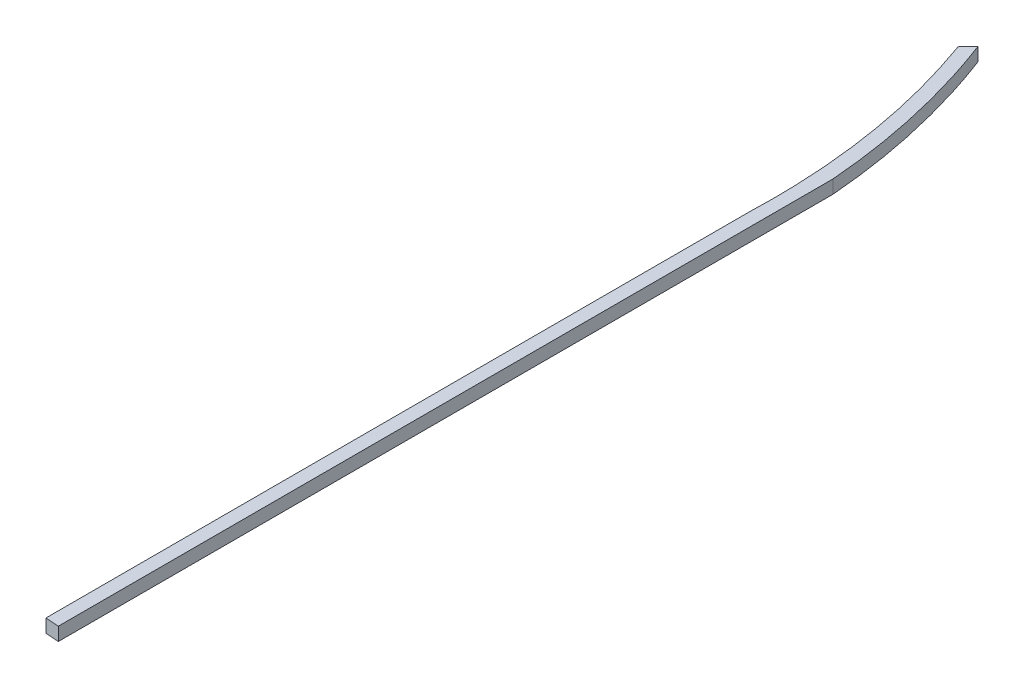
ISO-10303-21;
HEADER;
FILE_DESCRIPTION(('STEP AP214'),'2;1');
FILE_NAME('part.step','',(''),(''),'','','');
FILE_SCHEMA(('AUTOMOTIVE_DESIGN { 1 0 10303 214 1 1 1 1 }'));
ENDSEC;
DATA;
#1=APPLICATION_CONTEXT('core data for automotive mechanical design processes');
#2=APPLICATION_PROTOCOL_DEFINITION('international standard','automotive_design',2000,#1);
#3=PRODUCT_CONTEXT('',#1,'mechanical');
#4=PRODUCT('Part','Part','',(#3));
#5=PRODUCT_RELATED_PRODUCT_CATEGORY('part','',(#4));
#6=PRODUCT_DEFINITION_FORMATION('','',#4);
#7=PRODUCT_DEFINITION_CONTEXT('part definition',#1,'design');
#8=PRODUCT_DEFINITION('design','',#6,#7);
#9=PRODUCT_DEFINITION_SHAPE('','',#8);
#10=(LENGTH_UNIT() NAMED_UNIT(*) SI_UNIT(.MILLI.,.METRE.));
#11=(NAMED_UNIT(*) PLANE_ANGLE_UNIT() SI_UNIT($,.RADIAN.));
#12=(NAMED_UNIT(*) SI_UNIT($,.STERADIAN.) SOLID_ANGLE_UNIT());
#13=UNCERTAINTY_MEASURE_WITH_UNIT(LENGTH_MEASURE(1.E-05),#10,'distance_accuracy_value','');
#14=(GEOMETRIC_REPRESENTATION_CONTEXT(3) GLOBAL_UNCERTAINTY_ASSIGNED_CONTEXT((#13)) GLOBAL_UNIT_ASSIGNED_CONTEXT((#10,
#11,#12)) REPRESENTATION_CONTEXT('',''));
#15=CARTESIAN_POINT('',(0.,0.,0.));
#16=DIRECTION('',(0.,0.,1.));
#17=DIRECTION('',(1.,0.,0.));
#18=AXIS2_PLACEMENT_3D('',#15,#16,#17);
#19=CARTESIAN_POINT('',(0.,5.7,0.));
#20=DIRECTION('',(0.0748016767416655,0.,-0.997198430181594));
#21=DIRECTION('',(-0.997198430181594,0.,-0.0748016767416655));
#22=AXIS2_PLACEMENT_3D('',#19,#20,#21);
#23=PLANE('',#22);
#24=DIRECTION('',(0.997198430181594,0.,0.0748016767416655));
#25=VECTOR('',#24,1.);
#26=CARTESIAN_POINT('',(0.,0.,0.));
#27=LINE('',#26,#25);
#28=CARTESIAN_POINT('',(0.,0.,0.));
#29=VERTEX_POINT('',#28);
#30=CARTESIAN_POINT('',(5.7,0.,0.427567417399413));
#31=VERTEX_POINT('',#30);
#32=EDGE_CURVE('E189',#29,#31,#27,.T.);
#33=ORIENTED_EDGE('',*,*,#32,.T.);
#34=DIRECTION('',(0.,-1.,0.));
#35=VECTOR('',#34,1.);
#36=CARTESIAN_POINT('',(5.7,5.7,0.427567417399413));
#37=LINE('',#36,#35);
#38=CARTESIAN_POINT('',(5.7,5.7,0.427567417399413));
#39=VERTEX_POINT('',#38);
#40=EDGE_CURVE('E11',#39,#31,#37,.T.);
#41=ORIENTED_EDGE('',*,*,#40,.F.);
#42=DIRECTION('',(0.997198430181594,0.,0.0748016767416655));
#43=VECTOR('',#42,1.);
#44=CARTESIAN_POINT('',(0.,5.7,0.));
#45=LINE('',#44,#43);
#46=CARTESIAN_POINT('',(0.,5.7,0.));
#47=VERTEX_POINT('',#46);
#48=EDGE_CURVE('E160',#47,#39,#45,.T.);
#49=ORIENTED_EDGE('',*,*,#48,.F.);
#50=DIRECTION('',(0.,-1.,0.));
#51=VECTOR('',#50,1.);
#52=CARTESIAN_POINT('',(0.,5.7,0.));
#53=LINE('',#52,#51);
#54=EDGE_CURVE('E128',#47,#29,#53,.T.);
#55=ORIENTED_EDGE('',*,*,#54,.T.);
#56=EDGE_LOOP('',(#33,#41,#49,#55));
#57=FACE_BOUND('',#56,.T.);
#58=ADVANCED_FACE('F43',(#57),#23,.F.);
#59=CARTESIAN_POINT('',(5.69999999999996,5.7,-331.474));
#60=DIRECTION('',(-1.,0.,0.));
#61=DIRECTION('',(0.,0.,1.));
#62=AXIS2_PLACEMENT_3D('',#59,#60,#61);
#63=PLANE('',#62);
#64=DIRECTION('',(0.,0.,-1.));
#65=VECTOR('',#64,1.);
#66=CARTESIAN_POINT('',(5.69999999999996,0.,-331.474));
#67=LINE('',#66,#65);
#68=CARTESIAN_POINT('',(5.7,0.,-331.474));
#69=VERTEX_POINT('',#68);
#70=EDGE_CURVE('E184',#31,#69,#67,.T.);
#71=ORIENTED_EDGE('',*,*,#70,.T.);
#72=DIRECTION('',(0.,-1.,0.));
#73=VECTOR('',#72,1.);
#74=CARTESIAN_POINT('',(5.7,5.7,-331.474));
#75=LINE('',#74,#73);
#76=CARTESIAN_POINT('',(5.7,5.7,-331.474));
#77=VERTEX_POINT('',#76);
#78=EDGE_CURVE('E52',#77,#69,#75,.T.);
#79=ORIENTED_EDGE('',*,*,#78,.F.);
#80=DIRECTION('',(0.,0.,-1.));
#81=VECTOR('',#80,1.);
#82=CARTESIAN_POINT('',(5.7,5.7,0.427567417399413));
#83=LINE('',#82,#81);
#84=EDGE_CURVE('E97',#39,#77,#83,.T.);
#85=ORIENTED_EDGE('',*,*,#84,.F.);
#86=ORIENTED_EDGE('',*,*,#40,.T.);
#87=EDGE_LOOP('',(#71,#79,#85,#86));
#88=FACE_BOUND('',#87,.T.);
#89=ADVANCED_FACE('F148',(#88),#63,.F.);
#90=CARTESIAN_POINT('',(5.7,5.7,-331.474));
#91=CARTESIAN_POINT('',(2.42962482863511,5.7,-372.72000831731));
#92=CARTESIAN_POINT('',(-12.3881691404506,5.7,-411.71042320401));
#93=B_SPLINE_CURVE_WITH_KNOTS('',2,(#90,#91,#92),.UNSPECIFIED.,.F.,.F.,(3,3),(0.,1.),.UNSPECIFIED.);
#94=DIRECTION('',(0.,-1.,0.));
#95=VECTOR('',#94,1.);
#96=SURFACE_OF_LINEAR_EXTRUSION('',#93,#95);
#97=CARTESIAN_POINT('',(5.7,0.,-331.474));
#98=CARTESIAN_POINT('',(2.42962482863511,0.,-372.72000831731));
#99=CARTESIAN_POINT('',(-12.3881691404506,0.,-411.71042320401));
#100=B_SPLINE_CURVE_WITH_KNOTS('',2,(#97,#98,#99),.UNSPECIFIED.,.F.,.F.,(3,3),(0.,1.),.UNSPECIFIED.);
#101=CARTESIAN_POINT('',(-12.3881691404506,0.,-411.71042320401));
#102=VERTEX_POINT('',#101);
#103=EDGE_CURVE('E180',#69,#102,#100,.T.);
#104=ORIENTED_EDGE('',*,*,#103,.T.);
#105=DIRECTION('',(0.,-1.,0.));
#106=VECTOR('',#105,1.);
#107=CARTESIAN_POINT('',(-12.3881691404506,5.7,-411.71042320401));
#108=LINE('',#107,#106);
#109=CARTESIAN_POINT('',(-12.3881691404506,5.7,-411.71042320401));
#110=VERTEX_POINT('',#109);
#111=EDGE_CURVE('E121',#110,#102,#108,.T.);
#112=ORIENTED_EDGE('',*,*,#111,.F.);
#113=EDGE_CURVE('E110',#77,#110,#93,.T.);
#114=ORIENTED_EDGE('',*,*,#113,.F.);
#115=ORIENTED_EDGE('',*,*,#78,.T.);
#116=EDGE_LOOP('',(#104,#112,#114,#115));
#117=FACE_BOUND('',#116,.T.);
#118=ADVANCED_FACE('F146',(#117),#96,.F.);
#119=CARTESIAN_POINT('',(-16.5437459305946,5.7,-407.327520260688));
#120=DIRECTION('',(0.725675456959386,0.,0.688037158274745));
#121=DIRECTION('',(0.688037158274745,0.,-0.725675456959386));
#122=AXIS2_PLACEMENT_3D('',#119,#120,#121);
#123=PLANE('',#122);
#124=DIRECTION('',(-0.688037158274745,0.,0.725675456959386));
#125=VECTOR('',#124,1.);
#126=CARTESIAN_POINT('',(-16.5437459305946,0.,-407.327520260688));
#127=LINE('',#126,#125);
#128=CARTESIAN_POINT('',(-16.5437459305946,0.,-407.327520260688));
#129=VERTEX_POINT('',#128);
#130=EDGE_CURVE('E119',#102,#129,#127,.T.);
#131=ORIENTED_EDGE('',*,*,#130,.T.);
#132=DIRECTION('',(0.,-1.,0.));
#133=VECTOR('',#132,1.);
#134=CARTESIAN_POINT('',(-16.5437459305946,5.7,-407.327520260688));
#135=LINE('',#134,#133);
#136=CARTESIAN_POINT('',(-16.5437459305946,5.7,-407.327520260688));
#137=VERTEX_POINT('',#136);
#138=EDGE_CURVE('E116',#137,#129,#135,.T.);
#139=ORIENTED_EDGE('',*,*,#138,.F.);
#140=DIRECTION('',(-0.688037158274745,0.,0.725675456959386));
#141=VECTOR('',#140,1.);
#142=CARTESIAN_POINT('',(-16.5437459305946,5.7,-407.327520260688));
#143=LINE('',#142,#141);
#144=EDGE_CURVE('E104',#110,#137,#143,.T.);
#145=ORIENTED_EDGE('',*,*,#144,.F.);
#146=ORIENTED_EDGE('',*,*,#111,.T.);
#147=EDGE_LOOP('',(#131,#139,#145,#146));
#148=FACE_BOUND('',#147,.T.);
#149=ADVANCED_FACE('F117',(#148),#123,.F.);
#150=CARTESIAN_POINT('',(-16.5437459305946,5.7,-407.327520260688));
#151=CARTESIAN_POINT('',(1.94715290932234,5.7,-355.934632045384));
#152=CARTESIAN_POINT('',(0.,5.7,-301.474));
#153=B_SPLINE_CURVE_WITH_KNOTS('',2,(#150,#151,#152),.UNSPECIFIED.,.F.,.F.,(3,3),(0.,1.),.UNSPECIFIED.);
#154=DIRECTION('',(0.,-1.,0.));
#155=VECTOR('',#154,1.);
#156=SURFACE_OF_LINEAR_EXTRUSION('',#153,#155);
#157=CARTESIAN_POINT('',(-16.5437459305946,0.,-407.327520260688));
#158=CARTESIAN_POINT('',(1.94715290932234,0.,-355.934632045384));
#159=CARTESIAN_POINT('',(0.,0.,-301.474));
#160=B_SPLINE_CURVE_WITH_KNOTS('',2,(#157,#158,#159),.UNSPECIFIED.,.F.,.F.,(3,3),(0.,1.),.UNSPECIFIED.);
#161=CARTESIAN_POINT('',(0.,0.,-301.474));
#162=VERTEX_POINT('',#161);
#163=EDGE_CURVE('E83',#129,#162,#160,.T.);
#164=ORIENTED_EDGE('',*,*,#163,.T.);
#165=DIRECTION('',(0.,-1.,0.));
#166=VECTOR('',#165,1.);
#167=CARTESIAN_POINT('',(0.,5.7,-301.474));
#168=LINE('',#167,#166);
#169=CARTESIAN_POINT('',(0.,5.7,-301.474));
#170=VERTEX_POINT('',#169);
#171=EDGE_CURVE('E122',#170,#162,#168,.T.);
#172=ORIENTED_EDGE('',*,*,#171,.F.);
#173=EDGE_CURVE('E108',#137,#170,#153,.T.);
#174=ORIENTED_EDGE('',*,*,#173,.F.);
#175=ORIENTED_EDGE('',*,*,#138,.T.);
#176=EDGE_LOOP('',(#164,#172,#174,#175));
#177=FACE_BOUND('',#176,.T.);
#178=ADVANCED_FACE('F124',(#177),#156,.F.);
#179=CARTESIAN_POINT('',(0.,5.7,0.));
#180=DIRECTION('',(1.,0.,0.));
#181=DIRECTION('',(0.,0.,-1.));
#182=AXIS2_PLACEMENT_3D('',#179,#180,#181);
#183=PLANE('',#182);
#184=DIRECTION('',(0.,0.,1.));
#185=VECTOR('',#184,1.);
#186=CARTESIAN_POINT('',(0.,0.,0.));
#187=LINE('',#186,#185);
#188=EDGE_CURVE('E89',#162,#29,#187,.T.);
#189=ORIENTED_EDGE('',*,*,#188,.T.);
#190=ORIENTED_EDGE('',*,*,#54,.F.);
#191=DIRECTION('',(0.,0.,1.));
#192=VECTOR('',#191,1.);
#193=CARTESIAN_POINT('',(0.,5.7,0.));
#194=LINE('',#193,#192);
#195=EDGE_CURVE('E60',#170,#47,#194,.T.);
#196=ORIENTED_EDGE('',*,*,#195,.F.);
#197=ORIENTED_EDGE('',*,*,#171,.T.);
#198=EDGE_LOOP('',(#189,#190,#196,#197));
#199=FACE_BOUND('',#198,.T.);
#200=ADVANCED_FACE('F142',(#199),#183,.F.);
#201=CARTESIAN_POINT('',(-0.457229870795104,5.7,-372.156109959658));
#202=DIRECTION('',(0.,-1.,0.));
#203=DIRECTION('',(0.,0.,-1.));
#204=AXIS2_PLACEMENT_3D('',#201,#202,#203);
#205=PLANE('',#204);
#206=ORIENTED_EDGE('',*,*,#48,.T.);
#207=ORIENTED_EDGE('',*,*,#84,.T.);
#208=ORIENTED_EDGE('',*,*,#113,.T.);
#209=ORIENTED_EDGE('',*,*,#144,.T.);
#210=ORIENTED_EDGE('',*,*,#173,.T.);
#211=ORIENTED_EDGE('',*,*,#195,.T.);
#212=EDGE_LOOP('',(#206,#207,#208,#209,#210,#211));
#213=FACE_BOUND('',#212,.T.);
#214=ADVANCED_FACE('F106',(#213),#205,.F.);
#215=CARTESIAN_POINT('',(-0.457229870795104,0.,-372.156109959658));
#216=DIRECTION('',(0.,-1.,0.));
#217=DIRECTION('',(0.,0.,-1.));
#218=AXIS2_PLACEMENT_3D('',#215,#216,#217);
#219=PLANE('',#218);
#220=ORIENTED_EDGE('',*,*,#32,.F.);
#221=ORIENTED_EDGE('',*,*,#188,.F.);
#222=ORIENTED_EDGE('',*,*,#163,.F.);
#223=ORIENTED_EDGE('',*,*,#130,.F.);
#224=ORIENTED_EDGE('',*,*,#103,.F.);
#225=ORIENTED_EDGE('',*,*,#70,.F.);
#226=EDGE_LOOP('',(#220,#221,#222,#223,#224,#225));
#227=FACE_BOUND('',#226,.T.);
#228=ADVANCED_FACE('F183',(#227),#219,.T.);
#229=CLOSED_SHELL('',(#58,#89,#118,#149,#178,#200,#214,#228));
#230=MANIFOLD_SOLID_BREP('B2',#229);
#231=ADVANCED_BREP_SHAPE_REPRESENTATION('',(#18,#230),#14);
#232=SHAPE_DEFINITION_REPRESENTATION(#9,#231);
ENDSEC;
END-ISO-10303-21;
